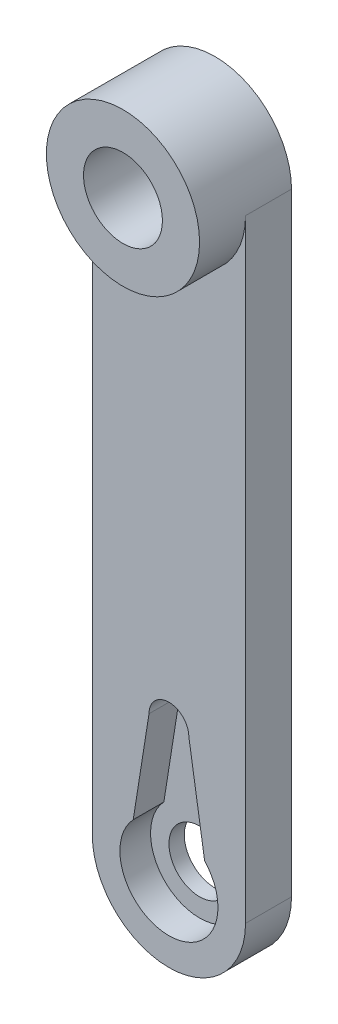
ISO-10303-21;
HEADER;
FILE_DESCRIPTION(('STEP AP214'),'2;1');
FILE_NAME('part.step','',(''),(''),'','','');
FILE_SCHEMA(('AUTOMOTIVE_DESIGN { 1 0 10303 214 1 1 1 1 }'));
ENDSEC;
DATA;
#1=APPLICATION_CONTEXT('core data for automotive mechanical design processes');
#2=APPLICATION_PROTOCOL_DEFINITION('international standard','automotive_design',2000,#1);
#3=PRODUCT_CONTEXT('',#1,'mechanical');
#4=PRODUCT('Part','Part','',(#3));
#5=PRODUCT_RELATED_PRODUCT_CATEGORY('part','',(#4));
#6=PRODUCT_DEFINITION_FORMATION('','',#4);
#7=PRODUCT_DEFINITION_CONTEXT('part definition',#1,'design');
#8=PRODUCT_DEFINITION('design','',#6,#7);
#9=PRODUCT_DEFINITION_SHAPE('','',#8);
#10=(LENGTH_UNIT() NAMED_UNIT(*) SI_UNIT(.MILLI.,.METRE.));
#11=(NAMED_UNIT(*) PLANE_ANGLE_UNIT() SI_UNIT($,.RADIAN.));
#12=(NAMED_UNIT(*) SI_UNIT($,.STERADIAN.) SOLID_ANGLE_UNIT());
#13=UNCERTAINTY_MEASURE_WITH_UNIT(LENGTH_MEASURE(1.E-05),#10,'distance_accuracy_value','');
#14=(GEOMETRIC_REPRESENTATION_CONTEXT(3) GLOBAL_UNCERTAINTY_ASSIGNED_CONTEXT((#13)) GLOBAL_UNIT_ASSIGNED_CONTEXT((#10,
#11,#12)) REPRESENTATION_CONTEXT('',''));
#15=CARTESIAN_POINT('',(0.,0.,0.));
#16=DIRECTION('',(0.,0.,1.));
#17=DIRECTION('',(1.,0.,0.));
#18=AXIS2_PLACEMENT_3D('',#15,#16,#17);
#19=CARTESIAN_POINT('',(0.,0.,6.));
#20=DIRECTION('',(0.,0.,-1.));
#21=DIRECTION('',(-1.,0.,0.));
#22=AXIS2_PLACEMENT_3D('',#19,#20,#21);
#23=CYLINDRICAL_SURFACE('',#22,4.);
#24=CARTESIAN_POINT('',(0.,0.,0.));
#25=DIRECTION('',(0.,0.,1.));
#26=DIRECTION('',(1.,0.,0.));
#27=AXIS2_PLACEMENT_3D('',#24,#25,#26);
#28=CIRCLE('',#27,4.);
#29=CARTESIAN_POINT('',(4.,0.,0.));
#30=VERTEX_POINT('',#29);
#31=EDGE_CURVE('E106',#30,#30,#28,.T.);
#32=ORIENTED_EDGE('',*,*,#31,.F.);
#33=EDGE_LOOP('',(#32));
#34=FACE_BOUND('',#33,.T.);
#35=CARTESIAN_POINT('',(0.,0.,2.));
#36=DIRECTION('',(0.,0.,1.));
#37=DIRECTION('',(1.,0.,0.));
#38=AXIS2_PLACEMENT_3D('',#35,#36,#37);
#39=CIRCLE('',#38,4.);
#40=CARTESIAN_POINT('',(4.,0.,2.));
#41=VERTEX_POINT('',#40);
#42=EDGE_CURVE('E174',#41,#41,#39,.F.);
#43=ORIENTED_EDGE('',*,*,#42,.F.);
#44=EDGE_LOOP('',(#43));
#45=FACE_BOUND('',#44,.T.);
#46=ADVANCED_FACE('F36',(#34,#45),#23,.F.);
#47=CARTESIAN_POINT('',(-10.,0.,6.));
#48=DIRECTION('',(-1.,0.,0.));
#49=DIRECTION('',(0.,0.,1.));
#50=AXIS2_PLACEMENT_3D('',#47,#48,#49);
#51=PLANE('',#50);
#52=DIRECTION('',(0.,1.,0.));
#53=VECTOR('',#52,1.);
#54=CARTESIAN_POINT('',(-10.,0.,0.));
#55=LINE('',#54,#53);
#56=CARTESIAN_POINT('',(-10.,0.,0.));
#57=VERTEX_POINT('',#56);
#58=CARTESIAN_POINT('',(-10.,80.,0.));
#59=VERTEX_POINT('',#58);
#60=EDGE_CURVE('E86',#57,#59,#55,.T.);
#61=ORIENTED_EDGE('',*,*,#60,.F.);
#62=DIRECTION('',(0.,0.,-1.));
#63=VECTOR('',#62,1.);
#64=CARTESIAN_POINT('',(-10.,0.,6.));
#65=LINE('',#64,#63);
#66=CARTESIAN_POINT('',(-10.,0.,6.));
#67=VERTEX_POINT('',#66);
#68=EDGE_CURVE('E11',#67,#57,#65,.T.);
#69=ORIENTED_EDGE('',*,*,#68,.F.);
#70=DIRECTION('',(0.,1.,0.));
#71=VECTOR('',#70,1.);
#72=CARTESIAN_POINT('',(-10.,0.,6.));
#73=LINE('',#72,#71);
#74=CARTESIAN_POINT('',(-10.,80.,6.));
#75=VERTEX_POINT('',#74);
#76=EDGE_CURVE('E110',#67,#75,#73,.T.);
#77=ORIENTED_EDGE('',*,*,#76,.T.);
#78=DIRECTION('',(0.,0.,-1.));
#79=VECTOR('',#78,1.);
#80=CARTESIAN_POINT('',(-10.,80.,6.));
#81=LINE('',#80,#79);
#82=EDGE_CURVE('E102',#75,#59,#81,.T.);
#83=ORIENTED_EDGE('',*,*,#82,.T.);
#84=EDGE_LOOP('',(#61,#69,#77,#83));
#85=FACE_BOUND('',#84,.T.);
#86=ADVANCED_FACE('F38',(#85),#51,.T.);
#87=CARTESIAN_POINT('',(0.,0.,6.));
#88=DIRECTION('',(0.,0.,-1.));
#89=DIRECTION('',(-1.,0.,0.));
#90=AXIS2_PLACEMENT_3D('',#87,#88,#89);
#91=CYLINDRICAL_SURFACE('',#90,10.);
#92=CARTESIAN_POINT('',(0.,0.,0.));
#93=DIRECTION('',(0.,0.,1.));
#94=DIRECTION('',(1.,0.,0.));
#95=AXIS2_PLACEMENT_3D('',#92,#93,#94);
#96=CIRCLE('',#95,10.);
#97=CARTESIAN_POINT('',(10.,0.,0.));
#98=VERTEX_POINT('',#97);
#99=EDGE_CURVE('E107',#57,#98,#96,.T.);
#100=ORIENTED_EDGE('',*,*,#99,.T.);
#101=DIRECTION('',(0.,0.,-1.));
#102=VECTOR('',#101,1.);
#103=CARTESIAN_POINT('',(10.,0.,6.));
#104=LINE('',#103,#102);
#105=CARTESIAN_POINT('',(10.,0.,6.));
#106=VERTEX_POINT('',#105);
#107=EDGE_CURVE('E44',#106,#98,#104,.T.);
#108=ORIENTED_EDGE('',*,*,#107,.F.);
#109=CARTESIAN_POINT('',(0.,0.,6.));
#110=DIRECTION('',(0.,0.,1.));
#111=DIRECTION('',(1.,0.,0.));
#112=AXIS2_PLACEMENT_3D('',#109,#110,#111);
#113=CIRCLE('',#112,10.);
#114=EDGE_CURVE('E60',#67,#106,#113,.T.);
#115=ORIENTED_EDGE('',*,*,#114,.F.);
#116=ORIENTED_EDGE('',*,*,#68,.T.);
#117=EDGE_LOOP('',(#100,#108,#115,#116));
#118=FACE_BOUND('',#117,.T.);
#119=ADVANCED_FACE('F220',(#118),#91,.T.);
#120=CARTESIAN_POINT('',(10.,0.,6.));
#121=DIRECTION('',(1.,0.,0.));
#122=DIRECTION('',(0.,0.,-1.));
#123=AXIS2_PLACEMENT_3D('',#120,#121,#122);
#124=PLANE('',#123);
#125=DIRECTION('',(0.,-1.,0.));
#126=VECTOR('',#125,1.);
#127=CARTESIAN_POINT('',(10.,0.,0.));
#128=LINE('',#127,#126);
#129=CARTESIAN_POINT('',(10.,80.,0.));
#130=VERTEX_POINT('',#129);
#131=EDGE_CURVE('E83',#130,#98,#128,.T.);
#132=ORIENTED_EDGE('',*,*,#131,.F.);
#133=DIRECTION('',(0.,0.,-1.));
#134=VECTOR('',#133,1.);
#135=CARTESIAN_POINT('',(10.,80.,6.));
#136=LINE('',#135,#134);
#137=CARTESIAN_POINT('',(10.,80.,6.));
#138=VERTEX_POINT('',#137);
#139=EDGE_CURVE('E95',#138,#130,#136,.T.);
#140=ORIENTED_EDGE('',*,*,#139,.F.);
#141=DIRECTION('',(0.,-1.,0.));
#142=VECTOR('',#141,1.);
#143=CARTESIAN_POINT('',(10.,0.,6.));
#144=LINE('',#143,#142);
#145=EDGE_CURVE('E117',#138,#106,#144,.T.);
#146=ORIENTED_EDGE('',*,*,#145,.T.);
#147=ORIENTED_EDGE('',*,*,#107,.T.);
#148=EDGE_LOOP('',(#132,#140,#146,#147));
#149=FACE_BOUND('',#148,.T.);
#150=ADVANCED_FACE('F104',(#149),#124,.T.);
#151=CARTESIAN_POINT('',(0.,0.,6.));
#152=DIRECTION('',(0.,0.,1.));
#153=DIRECTION('',(1.,0.,0.));
#154=AXIS2_PLACEMENT_3D('',#151,#152,#153);
#155=PLANE('',#154);
#156=CARTESIAN_POINT('',(0.,0.,6.));
#157=DIRECTION('',(0.,0.,1.));
#158=DIRECTION('',(1.,0.,0.));
#159=AXIS2_PLACEMENT_3D('',#156,#157,#158);
#160=CIRCLE('',#159,6.4);
#161=CARTESIAN_POINT('',(-4.66130026511556,4.38546232892651,6.));
#162=VERTEX_POINT('',#161);
#163=CARTESIAN_POINT('',(4.66130026511558,4.38546232892651,6.));
#164=VERTEX_POINT('',#163);
#165=EDGE_CURVE('E51',#162,#164,#160,.T.);
#166=ORIENTED_EDGE('',*,*,#165,.F.);
#167=DIRECTION('',(-0.156434465040231,-0.987688340595138,0.));
#168=VECTOR('',#167,1.);
#169=CARTESIAN_POINT('',(-5.22482132224574,0.827530400919595,6.));
#170=LINE('',#169,#168);
#171=CARTESIAN_POINT('',(-2.6,17.4,6.));
#172=VERTEX_POINT('',#171);
#173=EDGE_CURVE('E179',#172,#162,#170,.T.);
#174=ORIENTED_EDGE('',*,*,#173,.F.);
#175=CARTESIAN_POINT('',(0.,17.4,6.));
#176=DIRECTION('',(0.,0.,1.));
#177=DIRECTION('',(1.,0.,0.));
#178=AXIS2_PLACEMENT_3D('',#175,#176,#177);
#179=CIRCLE('',#178,2.6);
#180=CARTESIAN_POINT('',(2.6,17.4,6.));
#181=VERTEX_POINT('',#180);
#182=EDGE_CURVE('E182',#181,#172,#179,.T.);
#183=ORIENTED_EDGE('',*,*,#182,.F.);
#184=DIRECTION('',(0.156434465040231,-0.987688340595138,0.));
#185=VECTOR('',#184,1.);
#186=CARTESIAN_POINT('',(5.22482132224575,0.827530400919597,6.));
#187=LINE('',#186,#185);
#188=EDGE_CURVE('E190',#181,#164,#187,.T.);
#189=ORIENTED_EDGE('',*,*,#188,.T.);
#190=EDGE_LOOP('',(#166,#174,#183,#189));
#191=FACE_BOUND('',#190,.T.);
#192=ORIENTED_EDGE('',*,*,#76,.F.);
#193=ORIENTED_EDGE('',*,*,#114,.T.);
#194=ORIENTED_EDGE('',*,*,#145,.F.);
#195=CARTESIAN_POINT('',(0.,80.,6.));
#196=DIRECTION('',(0.,0.,1.));
#197=DIRECTION('',(1.,0.,0.));
#198=AXIS2_PLACEMENT_3D('',#195,#196,#197);
#199=CIRCLE('',#198,10.);
#200=EDGE_CURVE('E99',#75,#138,#199,.T.);
#201=ORIENTED_EDGE('',*,*,#200,.F.);
#202=EDGE_LOOP('',(#192,#193,#194,#201));
#203=FACE_BOUND('',#202,.T.);
#204=ADVANCED_FACE('F133',(#191,#203),#155,.T.);
#205=CARTESIAN_POINT('',(0.,0.,0.));
#206=DIRECTION('',(0.,0.,1.));
#207=DIRECTION('',(1.,0.,0.));
#208=AXIS2_PLACEMENT_3D('',#205,#206,#207);
#209=PLANE('',#208);
#210=ORIENTED_EDGE('',*,*,#60,.T.);
#211=CARTESIAN_POINT('',(0.,80.,0.));
#212=DIRECTION('',(0.,0.,1.));
#213=DIRECTION('',(1.,0.,0.));
#214=AXIS2_PLACEMENT_3D('',#211,#212,#213);
#215=CIRCLE('',#214,10.);
#216=EDGE_CURVE('E77',#130,#59,#215,.T.);
#217=ORIENTED_EDGE('',*,*,#216,.F.);
#218=ORIENTED_EDGE('',*,*,#131,.T.);
#219=ORIENTED_EDGE('',*,*,#99,.F.);
#220=EDGE_LOOP('',(#210,#217,#218,#219));
#221=FACE_BOUND('',#220,.T.);
#222=ORIENTED_EDGE('',*,*,#31,.T.);
#223=EDGE_LOOP('',(#222));
#224=FACE_BOUND('',#223,.T.);
#225=CARTESIAN_POINT('',(0.,80.,0.));
#226=DIRECTION('',(0.,0.,1.));
#227=DIRECTION('',(1.,0.,0.));
#228=AXIS2_PLACEMENT_3D('',#225,#226,#227);
#229=CIRCLE('',#228,5.15);
#230=CARTESIAN_POINT('',(5.15,80.,0.));
#231=VERTEX_POINT('',#230);
#232=EDGE_CURVE('E91',#231,#231,#229,.T.);
#233=ORIENTED_EDGE('',*,*,#232,.T.);
#234=EDGE_LOOP('',(#233));
#235=FACE_BOUND('',#234,.T.);
#236=ADVANCED_FACE('F79',(#221,#224,#235),#209,.F.);
#237=CARTESIAN_POINT('',(0.,80.,12.));
#238=DIRECTION('',(0.,0.,-1.));
#239=DIRECTION('',(-1.,0.,0.));
#240=AXIS2_PLACEMENT_3D('',#237,#238,#239);
#241=CYLINDRICAL_SURFACE('',#240,10.);
#242=CARTESIAN_POINT('',(0.,80.,12.));
#243=DIRECTION('',(0.,0.,1.));
#244=DIRECTION('',(1.,0.,0.));
#245=AXIS2_PLACEMENT_3D('',#242,#243,#244);
#246=CIRCLE('',#245,10.);
#247=CARTESIAN_POINT('',(10.,80.,12.));
#248=VERTEX_POINT('',#247);
#249=EDGE_CURVE('E121',#248,#248,#246,.T.);
#250=ORIENTED_EDGE('',*,*,#249,.F.);
#251=EDGE_LOOP('',(#250));
#252=FACE_BOUND('',#251,.T.);
#253=ORIENTED_EDGE('',*,*,#216,.T.);
#254=ORIENTED_EDGE('',*,*,#82,.F.);
#255=ORIENTED_EDGE('',*,*,#200,.T.);
#256=ORIENTED_EDGE('',*,*,#139,.T.);
#257=EDGE_LOOP('',(#253,#254,#255,#256));
#258=FACE_BOUND('',#257,.T.);
#259=ADVANCED_FACE('F96',(#252,#258),#241,.T.);
#260=CARTESIAN_POINT('',(0.,80.,12.));
#261=DIRECTION('',(0.,0.,-1.));
#262=DIRECTION('',(-1.,0.,0.));
#263=AXIS2_PLACEMENT_3D('',#260,#261,#262);
#264=CYLINDRICAL_SURFACE('',#263,5.15);
#265=CARTESIAN_POINT('',(0.,80.,12.));
#266=DIRECTION('',(0.,0.,1.));
#267=DIRECTION('',(1.,0.,0.));
#268=AXIS2_PLACEMENT_3D('',#265,#266,#267);
#269=CIRCLE('',#268,5.15);
#270=CARTESIAN_POINT('',(5.15,80.,12.));
#271=VERTEX_POINT('',#270);
#272=EDGE_CURVE('E90',#271,#271,#269,.T.);
#273=ORIENTED_EDGE('',*,*,#272,.T.);
#274=EDGE_LOOP('',(#273));
#275=FACE_BOUND('',#274,.T.);
#276=ORIENTED_EDGE('',*,*,#232,.F.);
#277=EDGE_LOOP('',(#276));
#278=FACE_BOUND('',#277,.T.);
#279=ADVANCED_FACE('F254',(#275,#278),#264,.F.);
#280=CARTESIAN_POINT('',(0.,0.,12.));
#281=DIRECTION('',(0.,0.,1.));
#282=DIRECTION('',(1.,0.,0.));
#283=AXIS2_PLACEMENT_3D('',#280,#281,#282);
#284=PLANE('',#283);
#285=ORIENTED_EDGE('',*,*,#272,.F.);
#286=EDGE_LOOP('',(#285));
#287=FACE_BOUND('',#286,.T.);
#288=ORIENTED_EDGE('',*,*,#249,.T.);
#289=EDGE_LOOP('',(#288));
#290=FACE_BOUND('',#289,.T.);
#291=ADVANCED_FACE('F211',(#287,#290),#284,.T.);
#292=CARTESIAN_POINT('',(0.,0.,2.));
#293=DIRECTION('',(0.,0.,1.));
#294=DIRECTION('',(1.,0.,0.));
#295=AXIS2_PLACEMENT_3D('',#292,#293,#294);
#296=CYLINDRICAL_SURFACE('',#295,6.4);
#297=ORIENTED_EDGE('',*,*,#165,.T.);
#298=DIRECTION('',(0.,0.,1.));
#299=VECTOR('',#298,1.);
#300=CARTESIAN_POINT('',(4.66130026511557,4.38546232892651,2.));
#301=LINE('',#300,#299);
#302=CARTESIAN_POINT('',(4.66130026511557,4.38546232892651,2.));
#303=VERTEX_POINT('',#302);
#304=EDGE_CURVE('E161',#303,#164,#301,.T.);
#305=ORIENTED_EDGE('',*,*,#304,.F.);
#306=CARTESIAN_POINT('',(0.,0.,2.));
#307=DIRECTION('',(0.,0.,1.));
#308=DIRECTION('',(1.,0.,0.));
#309=AXIS2_PLACEMENT_3D('',#306,#307,#308);
#310=CIRCLE('',#309,6.4);
#311=CARTESIAN_POINT('',(-4.66130026511556,4.38546232892651,2.));
#312=VERTEX_POINT('',#311);
#313=EDGE_CURVE('E169',#312,#303,#310,.T.);
#314=ORIENTED_EDGE('',*,*,#313,.F.);
#315=DIRECTION('',(0.,0.,1.));
#316=VECTOR('',#315,1.);
#317=CARTESIAN_POINT('',(-4.66130026511556,4.38546232892651,2.));
#318=LINE('',#317,#316);
#319=EDGE_CURVE('E131',#312,#162,#318,.T.);
#320=ORIENTED_EDGE('',*,*,#319,.T.);
#321=EDGE_LOOP('',(#297,#305,#314,#320));
#322=FACE_BOUND('',#321,.T.);
#323=ADVANCED_FACE('F172',(#322),#296,.F.);
#324=CARTESIAN_POINT('',(-5.22482132224574,0.827530400919595,2.));
#325=DIRECTION('',(-0.987688340595138,0.156434465040231,0.));
#326=DIRECTION('',(-0.156434465040231,-0.987688340595138,0.));
#327=AXIS2_PLACEMENT_3D('',#324,#325,#326);
#328=PLANE('',#327);
#329=ORIENTED_EDGE('',*,*,#173,.T.);
#330=ORIENTED_EDGE('',*,*,#319,.F.);
#331=DIRECTION('',(-0.156434465040231,-0.987688340595138,0.));
#332=VECTOR('',#331,1.);
#333=CARTESIAN_POINT('',(-5.22482132224574,0.827530400919595,2.));
#334=LINE('',#333,#332);
#335=CARTESIAN_POINT('',(-2.6,17.4,2.));
#336=VERTEX_POINT('',#335);
#337=EDGE_CURVE('E178',#336,#312,#334,.T.);
#338=ORIENTED_EDGE('',*,*,#337,.F.);
#339=DIRECTION('',(0.,0.,1.));
#340=VECTOR('',#339,1.);
#341=CARTESIAN_POINT('',(-2.6,17.4,2.));
#342=LINE('',#341,#340);
#343=EDGE_CURVE('E195',#336,#172,#342,.T.);
#344=ORIENTED_EDGE('',*,*,#343,.T.);
#345=EDGE_LOOP('',(#329,#330,#338,#344));
#346=FACE_BOUND('',#345,.T.);
#347=ADVANCED_FACE('F203',(#346),#328,.F.);
#348=CARTESIAN_POINT('',(0.,17.4,2.));
#349=DIRECTION('',(0.,0.,1.));
#350=DIRECTION('',(1.,0.,0.));
#351=AXIS2_PLACEMENT_3D('',#348,#349,#350);
#352=CYLINDRICAL_SURFACE('',#351,2.6);
#353=ORIENTED_EDGE('',*,*,#182,.T.);
#354=ORIENTED_EDGE('',*,*,#343,.F.);
#355=CARTESIAN_POINT('',(0.,17.4,2.));
#356=DIRECTION('',(0.,0.,1.));
#357=DIRECTION('',(1.,0.,0.));
#358=AXIS2_PLACEMENT_3D('',#355,#356,#357);
#359=CIRCLE('',#358,2.6);
#360=CARTESIAN_POINT('',(2.6,17.4,2.));
#361=VERTEX_POINT('',#360);
#362=EDGE_CURVE('E168',#361,#336,#359,.T.);
#363=ORIENTED_EDGE('',*,*,#362,.F.);
#364=DIRECTION('',(0.,0.,1.));
#365=VECTOR('',#364,1.);
#366=CARTESIAN_POINT('',(2.6,17.4,2.));
#367=LINE('',#366,#365);
#368=EDGE_CURVE('E163',#361,#181,#367,.T.);
#369=ORIENTED_EDGE('',*,*,#368,.T.);
#370=EDGE_LOOP('',(#353,#354,#363,#369));
#371=FACE_BOUND('',#370,.T.);
#372=ADVANCED_FACE('F198',(#371),#352,.F.);
#373=CARTESIAN_POINT('',(5.22482132224575,0.827530400919597,2.));
#374=DIRECTION('',(-0.987688340595138,-0.156434465040231,0.));
#375=DIRECTION('',(0.156434465040231,-0.987688340595138,0.));
#376=AXIS2_PLACEMENT_3D('',#373,#374,#375);
#377=PLANE('',#376);
#378=ORIENTED_EDGE('',*,*,#188,.F.);
#379=ORIENTED_EDGE('',*,*,#368,.F.);
#380=DIRECTION('',(0.156434465040231,-0.987688340595138,0.));
#381=VECTOR('',#380,1.);
#382=CARTESIAN_POINT('',(5.22482132224575,0.827530400919597,2.));
#383=LINE('',#382,#381);
#384=EDGE_CURVE('E158',#361,#303,#383,.T.);
#385=ORIENTED_EDGE('',*,*,#384,.T.);
#386=ORIENTED_EDGE('',*,*,#304,.T.);
#387=EDGE_LOOP('',(#378,#379,#385,#386));
#388=FACE_BOUND('',#387,.T.);
#389=ADVANCED_FACE('F160',(#388),#377,.T.);
#390=CARTESIAN_POINT('',(0.,0.,2.));
#391=DIRECTION('',(0.,0.,1.));
#392=DIRECTION('',(1.,0.,0.));
#393=AXIS2_PLACEMENT_3D('',#390,#391,#392);
#394=PLANE('',#393);
#395=ORIENTED_EDGE('',*,*,#313,.T.);
#396=ORIENTED_EDGE('',*,*,#384,.F.);
#397=ORIENTED_EDGE('',*,*,#362,.T.);
#398=ORIENTED_EDGE('',*,*,#337,.T.);
#399=EDGE_LOOP('',(#395,#396,#397,#398));
#400=FACE_BOUND('',#399,.T.);
#401=ORIENTED_EDGE('',*,*,#42,.T.);
#402=EDGE_LOOP('',(#401));
#403=FACE_BOUND('',#402,.T.);
#404=ADVANCED_FACE('F175',(#400,#403),#394,.T.);
#405=CLOSED_SHELL('',(#46,#86,#119,#150,#204,#236,#259,#279,#291,#323,#347,#372,#389,#404));
#406=MANIFOLD_SOLID_BREP('B2',#405);
#407=ADVANCED_BREP_SHAPE_REPRESENTATION('',(#18,#406),#14);
#408=SHAPE_DEFINITION_REPRESENTATION(#9,#407);
ENDSEC;
END-ISO-10303-21;
